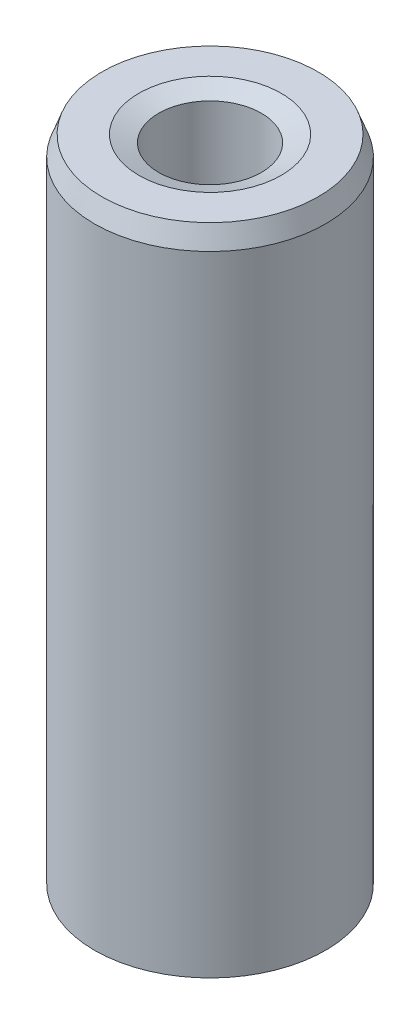
ISO-10303-21;
HEADER;
FILE_DESCRIPTION(('STEP AP214'),'2;1');
FILE_NAME('part.step','',(''),(''),'','','');
FILE_SCHEMA(('AUTOMOTIVE_DESIGN { 1 0 10303 214 1 1 1 1 }'));
ENDSEC;
DATA;
#1=APPLICATION_CONTEXT('core data for automotive mechanical design processes');
#2=APPLICATION_PROTOCOL_DEFINITION('international standard','automotive_design',2000,#1);
#3=PRODUCT_CONTEXT('',#1,'mechanical');
#4=PRODUCT('Part','Part','',(#3));
#5=PRODUCT_RELATED_PRODUCT_CATEGORY('part','',(#4));
#6=PRODUCT_DEFINITION_FORMATION('','',#4);
#7=PRODUCT_DEFINITION_CONTEXT('part definition',#1,'design');
#8=PRODUCT_DEFINITION('design','',#6,#7);
#9=PRODUCT_DEFINITION_SHAPE('','',#8);
#10=(LENGTH_UNIT() NAMED_UNIT(*) SI_UNIT(.MILLI.,.METRE.));
#11=(NAMED_UNIT(*) PLANE_ANGLE_UNIT() SI_UNIT($,.RADIAN.));
#12=(NAMED_UNIT(*) SI_UNIT($,.STERADIAN.) SOLID_ANGLE_UNIT());
#13=UNCERTAINTY_MEASURE_WITH_UNIT(LENGTH_MEASURE(1.E-05),#10,'distance_accuracy_value','');
#14=(GEOMETRIC_REPRESENTATION_CONTEXT(3) GLOBAL_UNCERTAINTY_ASSIGNED_CONTEXT((#13)) GLOBAL_UNIT_ASSIGNED_CONTEXT((#10,
#11,#12)) REPRESENTATION_CONTEXT('',''));
#15=CARTESIAN_POINT('',(0.,0.,0.));
#16=DIRECTION('',(0.,0.,1.));
#17=DIRECTION('',(1.,0.,0.));
#18=AXIS2_PLACEMENT_3D('',#15,#16,#17);
#19=CARTESIAN_POINT('',(0.,42.5998783420221,0.));
#20=DIRECTION('',(0.,-1.,0.));
#21=DIRECTION('',(0.,0.,-1.));
#22=AXIS2_PLACEMENT_3D('',#19,#20,#21);
#23=CYLINDRICAL_SURFACE('',#22,7.5);
#24=CARTESIAN_POINT('',(0.,0.478162760199428,0.));
#25=DIRECTION('',(0.,1.,0.));
#26=DIRECTION('',(0.,0.,1.));
#27=AXIS2_PLACEMENT_3D('',#24,#25,#26);
#28=CIRCLE('',#27,7.5);
#29=CARTESIAN_POINT('',(0.,0.478162760199428,7.5));
#30=VERTEX_POINT('',#29);
#31=EDGE_CURVE('E10',#30,#30,#28,.T.);
#32=ORIENTED_EDGE('',*,*,#31,.T.);
#33=EDGE_LOOP('',(#32));
#34=FACE_BOUND('',#33,.T.);
#35=CARTESIAN_POINT('',(0.,41.3136689326937,0.));
#36=DIRECTION('',(0.,1.,0.));
#37=DIRECTION('',(0.,0.,1.));
#38=AXIS2_PLACEMENT_3D('',#35,#36,#37);
#39=CIRCLE('',#38,7.5);
#40=CARTESIAN_POINT('',(0.,41.3136689326937,7.5));
#41=VERTEX_POINT('',#40);
#42=EDGE_CURVE('E50',#41,#41,#39,.F.);
#43=ORIENTED_EDGE('',*,*,#42,.T.);
#44=EDGE_LOOP('',(#43));
#45=FACE_BOUND('',#44,.T.);
#46=ADVANCED_FACE('F39',(#34,#45),#23,.T.);
#47=CARTESIAN_POINT('',(0.,42.5998783420221,0.));
#48=DIRECTION('',(0.,1.,0.));
#49=DIRECTION('',(0.,0.,1.));
#50=AXIS2_PLACEMENT_3D('',#47,#48,#49);
#51=PLANE('',#50);
#52=CARTESIAN_POINT('',(0.,42.5998783420221,0.));
#53=DIRECTION('',(0.,1.,0.));
#54=DIRECTION('',(0.,0.,1.));
#55=AXIS2_PLACEMENT_3D('',#52,#53,#54);
#56=CIRCLE('',#55,4.61997002723696);
#57=CARTESIAN_POINT('',(0.,42.5998783420221,4.61997002723696));
#58=VERTEX_POINT('',#57);
#59=EDGE_CURVE('E58',#58,#58,#56,.F.);
#60=ORIENTED_EDGE('',*,*,#59,.T.);
#61=EDGE_LOOP('',(#60));
#62=FACE_BOUND('',#61,.T.);
#63=CARTESIAN_POINT('',(0.,42.5998783420221,0.));
#64=DIRECTION('',(0.,1.,0.));
#65=DIRECTION('',(0.,0.,1.));
#66=AXIS2_PLACEMENT_3D('',#63,#64,#65);
#67=CIRCLE('',#66,7.02183723980056);
#68=CARTESIAN_POINT('',(0.,42.5998783420221,7.02183723980056));
#69=VERTEX_POINT('',#68);
#70=EDGE_CURVE('E61',#69,#69,#67,.T.);
#71=ORIENTED_EDGE('',*,*,#70,.T.);
#72=EDGE_LOOP('',(#71));
#73=FACE_BOUND('',#72,.T.);
#74=ADVANCED_FACE('F88',(#62,#73),#51,.T.);
#75=CARTESIAN_POINT('',(0.,0.,0.));
#76=DIRECTION('',(0.,1.,0.));
#77=DIRECTION('',(0.,0.,1.));
#78=AXIS2_PLACEMENT_3D('',#75,#76,#77);
#79=PLANE('',#78);
#80=CARTESIAN_POINT('',(0.,0.,0.));
#81=DIRECTION('',(0.,1.,0.));
#82=DIRECTION('',(0.,0.,1.));
#83=AXIS2_PLACEMENT_3D('',#80,#81,#82);
#84=CIRCLE('',#83,3.81192337810795);
#85=CARTESIAN_POINT('',(0.,0.,3.81192337810795));
#86=VERTEX_POINT('',#85);
#87=EDGE_CURVE('E51',#86,#86,#84,.T.);
#88=ORIENTED_EDGE('',*,*,#87,.T.);
#89=EDGE_LOOP('',(#88));
#90=FACE_BOUND('',#89,.T.);
#91=CARTESIAN_POINT('',(0.,0.,0.));
#92=DIRECTION('',(0.,1.,0.));
#93=DIRECTION('',(0.,0.,1.));
#94=AXIS2_PLACEMENT_3D('',#91,#92,#93);
#95=CIRCLE('',#94,6.21379059067159);
#96=CARTESIAN_POINT('',(0.,0.,6.21379059067159));
#97=VERTEX_POINT('',#96);
#98=EDGE_CURVE('E54',#97,#97,#95,.F.);
#99=ORIENTED_EDGE('',*,*,#98,.T.);
#100=EDGE_LOOP('',(#99));
#101=FACE_BOUND('',#100,.T.);
#102=ADVANCED_FACE('F83',(#90,#101),#79,.F.);
#103=CARTESIAN_POINT('',(0.,42.5998783420221,0.));
#104=DIRECTION('',(0.,-1.,0.));
#105=DIRECTION('',(0.,0.,-1.));
#106=AXIS2_PLACEMENT_3D('',#103,#104,#105);
#107=CYLINDRICAL_SURFACE('',#106,3.33376061790852);
#108=CARTESIAN_POINT('',(0.,42.1217155818227,0.));
#109=DIRECTION('',(0.,1.,0.));
#110=DIRECTION('',(0.,0.,1.));
#111=AXIS2_PLACEMENT_3D('',#108,#109,#110);
#112=CIRCLE('',#111,3.33376061790852);
#113=CARTESIAN_POINT('',(0.,42.1217155818227,3.33376061790852));
#114=VERTEX_POINT('',#113);
#115=EDGE_CURVE('E67',#114,#114,#112,.T.);
#116=ORIENTED_EDGE('',*,*,#115,.T.);
#117=EDGE_LOOP('',(#116));
#118=FACE_BOUND('',#117,.T.);
#119=CARTESIAN_POINT('',(0.,1.28620940932842,0.));
#120=DIRECTION('',(0.,1.,0.));
#121=DIRECTION('',(0.,0.,1.));
#122=AXIS2_PLACEMENT_3D('',#119,#120,#121);
#123=CIRCLE('',#122,3.33376061790852);
#124=CARTESIAN_POINT('',(0.,1.28620940932842,3.33376061790852));
#125=VERTEX_POINT('',#124);
#126=EDGE_CURVE('E69',#125,#125,#123,.F.);
#127=ORIENTED_EDGE('',*,*,#126,.T.);
#128=EDGE_LOOP('',(#127));
#129=FACE_BOUND('',#128,.T.);
#130=ADVANCED_FACE('F71',(#118,#129),#107,.F.);
#131=CARTESIAN_POINT('',(0.,42.1217155818227,0.));
#132=DIRECTION('',(0.,1.,0.));
#133=DIRECTION('',(0.,0.,1.));
#134=AXIS2_PLACEMENT_3D('',#131,#132,#133);
#135=CONICAL_SURFACE('',#134,3.33376061790852,1.21486816690691);
#136=ORIENTED_EDGE('',*,*,#59,.F.);
#137=EDGE_LOOP('',(#136));
#138=FACE_BOUND('',#137,.T.);
#139=ORIENTED_EDGE('',*,*,#115,.F.);
#140=EDGE_LOOP('',(#139));
#141=FACE_BOUND('',#140,.T.);
#142=ADVANCED_FACE('F77',(#138,#141),#135,.F.);
#143=CARTESIAN_POINT('',(0.,0.,0.));
#144=DIRECTION('',(0.,-1.,0.));
#145=DIRECTION('',(0.,0.,-1.));
#146=AXIS2_PLACEMENT_3D('',#143,#144,#145);
#147=CONICAL_SURFACE('',#146,3.81192337810795,0.355928159887986);
#148=ORIENTED_EDGE('',*,*,#126,.F.);
#149=EDGE_LOOP('',(#148));
#150=FACE_BOUND('',#149,.T.);
#151=ORIENTED_EDGE('',*,*,#87,.F.);
#152=EDGE_LOOP('',(#151));
#153=FACE_BOUND('',#152,.T.);
#154=ADVANCED_FACE('F73',(#150,#153),#147,.F.);
#155=CARTESIAN_POINT('',(0.,0.478162760199428,0.));
#156=DIRECTION('',(0.,1.,0.));
#157=DIRECTION('',(0.,0.,1.));
#158=AXIS2_PLACEMENT_3D('',#155,#156,#157);
#159=CONICAL_SURFACE('',#158,7.5,1.21486816690691);
#160=ORIENTED_EDGE('',*,*,#98,.F.);
#161=EDGE_LOOP('',(#160));
#162=FACE_BOUND('',#161,.T.);
#163=ORIENTED_EDGE('',*,*,#31,.F.);
#164=EDGE_LOOP('',(#163));
#165=FACE_BOUND('',#164,.T.);
#166=ADVANCED_FACE('F76',(#162,#165),#159,.T.);
#167=CARTESIAN_POINT('',(0.,42.5998783420221,0.));
#168=DIRECTION('',(0.,-1.,0.));
#169=DIRECTION('',(0.,0.,-1.));
#170=AXIS2_PLACEMENT_3D('',#167,#168,#169);
#171=CONICAL_SURFACE('',#170,7.02183723980056,0.355928159887986);
#172=ORIENTED_EDGE('',*,*,#42,.F.);
#173=EDGE_LOOP('',(#172));
#174=FACE_BOUND('',#173,.T.);
#175=ORIENTED_EDGE('',*,*,#70,.F.);
#176=EDGE_LOOP('',(#175));
#177=FACE_BOUND('',#176,.T.);
#178=ADVANCED_FACE('F45',(#174,#177),#171,.T.);
#179=CLOSED_SHELL('',(#46,#74,#102,#130,#142,#154,#166,#178));
#180=MANIFOLD_SOLID_BREP('B2',#179);
#181=ADVANCED_BREP_SHAPE_REPRESENTATION('',(#18,#180),#14);
#182=SHAPE_DEFINITION_REPRESENTATION(#9,#181);
ENDSEC;
END-ISO-10303-21;
